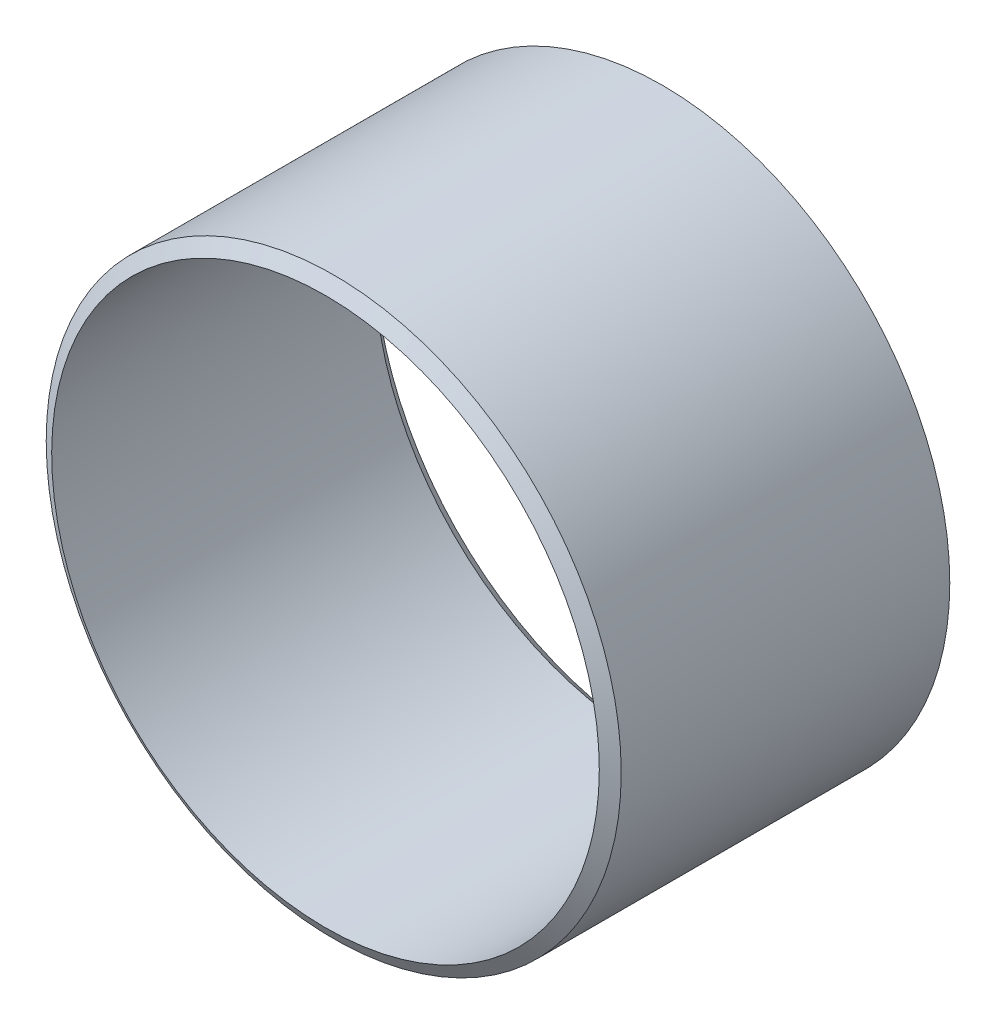
ISO-10303-21;
HEADER;
FILE_DESCRIPTION(('STEP AP214'),'2;1');
FILE_NAME('part.step','',(''),(''),'','','');
FILE_SCHEMA(('AUTOMOTIVE_DESIGN { 1 0 10303 214 1 1 1 1 }'));
ENDSEC;
DATA;
#1=APPLICATION_CONTEXT('core data for automotive mechanical design processes');
#2=APPLICATION_PROTOCOL_DEFINITION('international standard','automotive_design',2000,#1);
#3=PRODUCT_CONTEXT('',#1,'mechanical');
#4=PRODUCT('Part','Part','',(#3));
#5=PRODUCT_RELATED_PRODUCT_CATEGORY('part','',(#4));
#6=PRODUCT_DEFINITION_FORMATION('','',#4);
#7=PRODUCT_DEFINITION_CONTEXT('part definition',#1,'design');
#8=PRODUCT_DEFINITION('design','',#6,#7);
#9=PRODUCT_DEFINITION_SHAPE('','',#8);
#10=(LENGTH_UNIT() NAMED_UNIT(*) SI_UNIT(.MILLI.,.METRE.));
#11=(NAMED_UNIT(*) PLANE_ANGLE_UNIT() SI_UNIT($,.RADIAN.));
#12=(NAMED_UNIT(*) SI_UNIT($,.STERADIAN.) SOLID_ANGLE_UNIT());
#13=UNCERTAINTY_MEASURE_WITH_UNIT(LENGTH_MEASURE(1.E-05),#10,'distance_accuracy_value','');
#14=(GEOMETRIC_REPRESENTATION_CONTEXT(3) GLOBAL_UNCERTAINTY_ASSIGNED_CONTEXT((#13)) GLOBAL_UNIT_ASSIGNED_CONTEXT((#10,
#11,#12)) REPRESENTATION_CONTEXT('',''));
#15=CARTESIAN_POINT('',(0.,0.,0.));
#16=DIRECTION('',(0.,0.,1.));
#17=DIRECTION('',(1.,0.,0.));
#18=AXIS2_PLACEMENT_3D('',#15,#16,#17);
#19=CARTESIAN_POINT('',(19.75,0.,41.7036993663488));
#20=DIRECTION('',(0.,0.,1.));
#21=DIRECTION('',(0.005097725444884,0.999987006513229,0.));
#22=AXIS2_PLACEMENT_3D('',#19,#20,#21);
#23=CYLINDRICAL_SURFACE('',#22,2.);
#24=CARTESIAN_POINT('',(19.75,0.,40.4137854282515));
#25=DIRECTION('',(0.,0.,1.));
#26=DIRECTION('',(0.005097725444884,0.999987006513229,0.));
#27=AXIS2_PLACEMENT_3D('',#24,#25,#26);
#28=CIRCLE('',#27,2.);
#29=CARTESIAN_POINT('',(19.7398045491103,-1.99997401302646,40.4137854282515));
#30=VERTEX_POINT('',#29);
#31=EDGE_CURVE('E20',#30,#30,#28,.T.);
#32=ORIENTED_EDGE('',*,*,#31,.T.);
#33=EDGE_LOOP('',(#32));
#34=FACE_BOUND('',#33,.T.);
#35=CARTESIAN_POINT('',(19.75,0.,38.0536993663488));
#36=DIRECTION('',(0.,0.,1.));
#37=DIRECTION('',(0.005097725444884,0.999987006513229,0.));
#38=AXIS2_PLACEMENT_3D('',#35,#36,#37);
#39=CIRCLE('',#38,2.);
#40=CARTESIAN_POINT('',(19.7601954508897,1.99997401302645,38.0536993663488));
#41=VERTEX_POINT('',#40);
#42=EDGE_CURVE('E11',#41,#41,#39,.T.);
#43=ORIENTED_EDGE('',*,*,#42,.F.);
#44=EDGE_LOOP('',(#43));
#45=FACE_BOUND('',#44,.T.);
#46=ADVANCED_FACE('F16',(#34,#45),#23,.F.);
#47=CARTESIAN_POINT('',(19.75,0.,37.0536993663488));
#48=DIRECTION('',(0.,0.,-1.));
#49=DIRECTION('',(0.005097725444884,0.999987006513229,0.));
#50=AXIS2_PLACEMENT_3D('',#47,#48,#49);
#51=CONICAL_SURFACE('',#50,3.,0.7853981625);
#52=CARTESIAN_POINT('',(19.75,0.,37.9536993663488));
#53=DIRECTION('',(0.,0.,-1.));
#54=DIRECTION('',(1.,0.,0.));
#55=AXIS2_PLACEMENT_3D('',#52,#53,#54);
#56=CIRCLE('',#55,2.1);
#57=CARTESIAN_POINT('',(17.65,0.,37.9536993663488));
#58=VERTEX_POINT('',#57);
#59=EDGE_CURVE('E47',#58,#58,#56,.T.);
#60=ORIENTED_EDGE('',*,*,#59,.T.);
#61=EDGE_LOOP('',(#60));
#62=FACE_BOUND('',#61,.T.);
#63=ORIENTED_EDGE('',*,*,#42,.T.);
#64=EDGE_LOOP('',(#63));
#65=FACE_BOUND('',#64,.T.);
#66=ADVANCED_FACE('F18',(#62,#65),#51,.F.);
#67=CARTESIAN_POINT('',(19.75,0.,40.9846030163278));
#68=DIRECTION('',(0.,0.,-1.));
#69=DIRECTION('',(1.,0.,0.));
#70=AXIS2_PLACEMENT_3D('',#67,#68,#69);
#71=CONICAL_SURFACE('',#70,1.05,1.0297442575);
#72=CARTESIAN_POINT('',(19.75,0.,40.3536993663488));
#73=DIRECTION('',(0.,0.,-1.));
#74=DIRECTION('',(1.,0.,0.));
#75=AXIS2_PLACEMENT_3D('',#72,#73,#74);
#76=CIRCLE('',#75,2.1);
#77=CARTESIAN_POINT('',(21.85,0.,40.3536993663488));
#78=VERTEX_POINT('',#77);
#79=EDGE_CURVE('E50',#78,#78,#76,.T.);
#80=ORIENTED_EDGE('',*,*,#79,.F.);
#81=EDGE_LOOP('',(#80));
#82=FACE_BOUND('',#81,.T.);
#83=ORIENTED_EDGE('',*,*,#31,.F.);
#84=EDGE_LOOP('',(#83));
#85=FACE_BOUND('',#84,.T.);
#86=ADVANCED_FACE('F64',(#82,#85),#71,.T.);
#87=CARTESIAN_POINT('',(19.75,0.,37.8536993663488));
#88=DIRECTION('',(0.,0.,-1.));
#89=DIRECTION('',(1.,0.,0.));
#90=AXIS2_PLACEMENT_3D('',#87,#88,#89);
#91=CYLINDRICAL_SURFACE('',#90,2.1);
#92=ORIENTED_EDGE('',*,*,#79,.T.);
#93=EDGE_LOOP('',(#92));
#94=FACE_BOUND('',#93,.T.);
#95=ORIENTED_EDGE('',*,*,#59,.F.);
#96=EDGE_LOOP('',(#95));
#97=FACE_BOUND('',#96,.T.);
#98=ADVANCED_FACE('F66',(#94,#97),#91,.T.);
#99=CLOSED_SHELL('',(#46,#66,#86,#98));
#100=MANIFOLD_SOLID_BREP('B1',#99);
#101=ADVANCED_BREP_SHAPE_REPRESENTATION('',(#18,#100),#14);
#102=SHAPE_DEFINITION_REPRESENTATION(#9,#101);
ENDSEC;
END-ISO-10303-21;
